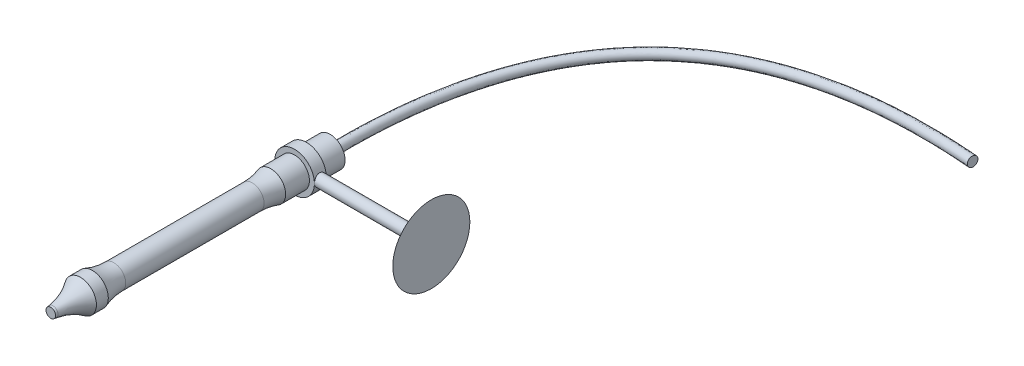
ISO-10303-21;
HEADER;
FILE_DESCRIPTION(('STEP AP214'),'2;1');
FILE_NAME('part.step','',(''),(''),'','','');
FILE_SCHEMA(('AUTOMOTIVE_DESIGN { 1 0 10303 214 1 1 1 1 }'));
ENDSEC;
DATA;
#1=APPLICATION_CONTEXT('core data for automotive mechanical design processes');
#2=APPLICATION_PROTOCOL_DEFINITION('international standard','automotive_design',2000,#1);
#3=PRODUCT_CONTEXT('',#1,'mechanical');
#4=PRODUCT('Part','Part','',(#3));
#5=PRODUCT_RELATED_PRODUCT_CATEGORY('part','',(#4));
#6=PRODUCT_DEFINITION_FORMATION('','',#4);
#7=PRODUCT_DEFINITION_CONTEXT('part definition',#1,'design');
#8=PRODUCT_DEFINITION('design','',#6,#7);
#9=PRODUCT_DEFINITION_SHAPE('','',#8);
#10=(LENGTH_UNIT() NAMED_UNIT(*) SI_UNIT(.MILLI.,.METRE.));
#11=(NAMED_UNIT(*) PLANE_ANGLE_UNIT() SI_UNIT($,.RADIAN.));
#12=(NAMED_UNIT(*) SI_UNIT($,.STERADIAN.) SOLID_ANGLE_UNIT());
#13=UNCERTAINTY_MEASURE_WITH_UNIT(LENGTH_MEASURE(1.E-05),#10,'distance_accuracy_value','');
#14=(GEOMETRIC_REPRESENTATION_CONTEXT(3) GLOBAL_UNCERTAINTY_ASSIGNED_CONTEXT((#13)) GLOBAL_UNIT_ASSIGNED_CONTEXT((#10,
#11,#12)) REPRESENTATION_CONTEXT('',''));
#15=CARTESIAN_POINT('',(0.,0.,0.));
#16=DIRECTION('',(0.,0.,1.));
#17=DIRECTION('',(1.,0.,0.));
#18=AXIS2_PLACEMENT_3D('',#15,#16,#17);
#19=CARTESIAN_POINT('',(0.,0.,4.));
#20=DIRECTION('',(0.,0.,1.));
#21=DIRECTION('',(1.,0.,0.));
#22=AXIS2_PLACEMENT_3D('',#19,#20,#21);
#23=CYLINDRICAL_SURFACE('',#22,3.33545911406675);
#24=CARTESIAN_POINT('',(0.,0.,4.));
#25=DIRECTION('',(0.,0.,-1.));
#26=DIRECTION('',(-1.,0.,0.));
#27=AXIS2_PLACEMENT_3D('',#24,#25,#26);
#28=CIRCLE('',#27,3.33545911406675);
#29=CARTESIAN_POINT('',(-3.33545911406675,0.,4.));
#30=VERTEX_POINT('',#29);
#31=EDGE_CURVE('E63',#30,#30,#28,.T.);
#32=ORIENTED_EDGE('',*,*,#31,.F.);
#33=EDGE_LOOP('',(#32));
#34=FACE_BOUND('',#33,.T.);
#35=CARTESIAN_POINT('',(0.,0.,6.));
#36=DIRECTION('',(0.,0.,-1.));
#37=DIRECTION('',(-1.,0.,0.));
#38=AXIS2_PLACEMENT_3D('',#35,#36,#37);
#39=CIRCLE('',#38,3.33545911406675);
#40=CARTESIAN_POINT('',(-3.33545911406675,0.,6.));
#41=VERTEX_POINT('',#40);
#42=EDGE_CURVE('E62',#41,#41,#39,.T.);
#43=ORIENTED_EDGE('',*,*,#42,.T.);
#44=EDGE_LOOP('',(#43));
#45=FACE_BOUND('',#44,.T.);
#46=CARTESIAN_POINT('',(3.33545911406675,0.,4.0123615803254));
#47=CARTESIAN_POINT('',(3.33545859474532,0.0542133240496529,4.01236232387684));
#48=CARTESIAN_POINT('',(3.33412468721525,0.108434184529217,4.01684020928572));
#49=CARTESIAN_POINT('',(3.32893368200549,0.215299004095399,4.03459226151468));
#50=CARTESIAN_POINT('',(3.32507577599388,0.267942452351953,4.04786924633869));
#51=CARTESIAN_POINT('',(3.31525987532415,0.370095511714682,4.08273883298903));
#52=CARTESIAN_POINT('',(3.30930493320031,0.419609555205668,4.10431935204747));
#53=CARTESIAN_POINT('',(3.295915162992,0.514316292113763,4.15513443939346));
#54=CARTESIAN_POINT('',(3.28848014949565,0.559508443066529,4.18436996678603));
#55=CARTESIAN_POINT('',(3.2726913390432,0.645555869772041,4.25052926292948));
#56=CARTESIAN_POINT('',(3.26431908206602,0.686272814123452,4.28762853201235));
#57=CARTESIAN_POINT('',(3.24771050900459,0.761007605381701,4.36808802331961));
#58=CARTESIAN_POINT('',(3.23947421528625,0.795024359974312,4.41144926442295));
#59=CARTESIAN_POINT('',(3.22387562790301,0.856114461558237,4.50436413942261));
#60=CARTESIAN_POINT('',(3.21653631853401,0.883020160804385,4.55403221935504));
#61=CARTESIAN_POINT('',(3.20383804372948,0.928041146304969,4.65744033353634));
#62=CARTESIAN_POINT('',(3.19847861665757,0.946158481994202,4.71117941505015));
#63=CARTESIAN_POINT('',(3.19053907662252,0.972591882833786,4.81965319708747));
#64=CARTESIAN_POINT('',(3.187886954268,0.981162475167788,4.87432046286353));
#65=CARTESIAN_POINT('',(3.1854479682639,0.989053755209431,4.98437632294314));
#66=CARTESIAN_POINT('',(3.18566043049727,0.988376619166253,5.03976474447351));
#67=CARTESIAN_POINT('',(3.18886271192411,0.977991844593223,5.14763132795278));
#68=CARTESIAN_POINT('',(3.19175487801695,0.968601705709039,5.20014343374472));
#69=CARTESIAN_POINT('',(3.19983290829458,0.941569905030586,5.30281084822294));
#70=CARTESIAN_POINT('',(3.20501899356802,0.923927447865862,5.35296592922286));
#71=CARTESIAN_POINT('',(3.21717940817788,0.880654971952299,5.45027836957983));
#72=CARTESIAN_POINT('',(3.22417679383611,0.854920973550015,5.49738648761944));
#73=CARTESIAN_POINT('',(3.23916013869764,0.796268204725903,5.58672277360935));
#74=CARTESIAN_POINT('',(3.24714633194111,0.763347731930148,5.62894978166258));
#75=CARTESIAN_POINT('',(3.26360477993206,0.689673939290382,5.70912766637599));
#76=CARTESIAN_POINT('',(3.27208360044128,0.648656736973535,5.74683512711562));
#77=CARTESIAN_POINT('',(3.28828403325024,0.560775574965283,5.81489214578275));
#78=CARTESIAN_POINT('',(3.29600560029437,0.51391126621399,5.84524126411412));
#79=CARTESIAN_POINT('',(3.30988897215643,0.415231866699017,5.89786278978185));
#80=CARTESIAN_POINT('',(3.3160405095211,0.363387092625176,5.92008242282251));
#81=CARTESIAN_POINT('',(3.3260167285635,0.256472291165546,5.95541562769836));
#82=CARTESIAN_POINT('',(3.32984204182267,0.201403143668695,5.96853167134033));
#83=CARTESIAN_POINT('',(3.33463543982902,0.0916731109890746,5.98488297386323));
#84=CARTESIAN_POINT('',(3.33569891673489,0.0370654964326703,5.98844825323522));
#85=CARTESIAN_POINT('',(3.33512799089891,-0.0719707270611069,5.98652015591804));
#86=CARTESIAN_POINT('',(3.33349393812181,-0.126399358301029,5.98102795430376));
#87=CARTESIAN_POINT('',(3.32777391494358,-0.232295271324664,5.96140817595549));
#88=CARTESIAN_POINT('',(3.32374243036412,-0.283801303316338,5.94747236605191));
#89=CARTESIAN_POINT('',(3.31369283249739,-0.383733818374663,5.91159069194744));
#90=CARTESIAN_POINT('',(3.3076744827287,-0.432159934043683,5.88964387422449));
#91=CARTESIAN_POINT('',(3.2941056600938,-0.525780656750882,5.83780218218657));
#92=CARTESIAN_POINT('',(3.28652346492846,-0.570876763874594,5.80773795131983));
#93=CARTESIAN_POINT('',(3.27069835550213,-0.655496754229677,5.74072147237581));
#94=CARTESIAN_POINT('',(3.26245528011169,-0.695019272042243,5.70376754158952));
#95=CARTESIAN_POINT('',(3.24587310157176,-0.768815953128473,5.62247097332805));
#96=CARTESIAN_POINT('',(3.23754088661774,-0.802855495652099,5.5779134998768));
#97=CARTESIAN_POINT('',(3.22203424603739,-0.86298936885423,5.48353809087203));
#98=CARTESIAN_POINT('',(3.2148597869735,-0.889083929013784,5.43372030731209));
#99=CARTESIAN_POINT('',(3.20256406341342,-0.932404778278876,5.33041159750006));
#100=CARTESIAN_POINT('',(3.19743285057474,-0.949674155766802,5.27693999164027));
#101=CARTESIAN_POINT('',(3.18982852883468,-0.974914655736116,5.16766826317063));
#102=CARTESIAN_POINT('',(3.18735453878674,-0.982888860611743,5.11186891882907));
#103=CARTESIAN_POINT('',(3.18543002280948,-0.989106837079643,5.00195847641877));
#104=CARTESIAN_POINT('',(3.18586086910518,-0.98773236916733,4.94787076579933));
#105=CARTESIAN_POINT('',(3.18941317481038,-0.976200136369812,4.8407345658914));
#106=CARTESIAN_POINT('',(3.19253453161151,-0.966042706441556,4.78768603705039));
#107=CARTESIAN_POINT('',(3.20103762949315,-0.937476437029475,4.68474042985967));
#108=CARTESIAN_POINT('',(3.20639231111525,-0.919166204991245,4.63481358970892));
#109=CARTESIAN_POINT('',(3.21875437264944,-0.874890678120699,4.53870078264029));
#110=CARTESIAN_POINT('',(3.22576206244756,-0.848923947711911,4.49251551933179));
#111=CARTESIAN_POINT('',(3.24095189232623,-0.788989851005709,4.40341903874876));
#112=CARTESIAN_POINT('',(3.24916695650304,-0.754770617418629,4.36068286163931));
#113=CARTESIAN_POINT('',(3.26568329629989,-0.679759336524921,4.28143555156332));
#114=CARTESIAN_POINT('',(3.27398459357433,-0.638965599013623,4.24492602435463));
#115=CARTESIAN_POINT('',(3.29001889545424,-0.550576160592224,4.17814299120523));
#116=CARTESIAN_POINT('',(3.29772924754409,-0.502820976000291,4.14807457607197));
#117=CARTESIAN_POINT('',(3.31144416480173,-0.402704738783865,4.09643638239578));
#118=CARTESIAN_POINT('',(3.31744956515563,-0.350345957793296,4.074862440747));
#119=CARTESIAN_POINT('',(3.32652213987926,-0.248676099276189,4.04286969867746));
#120=CARTESIAN_POINT('',(3.32984622601543,-0.199698039333411,4.03145958635817));
#121=CARTESIAN_POINT('',(3.33431478226766,-0.100482011016156,4.0162057779511));
#122=CARTESIAN_POINT('',(3.33545959536747,-0.050244242161485,4.01236089121107));
#123=CARTESIAN_POINT('',(3.33545911406675,0.,4.0123615803254));
#124=B_SPLINE_CURVE_WITH_KNOTS('',3,(#46,#47,#48,#49,#50,#51,#52,#53,#54,#55,#56,#57,#58,#59,
#60,#61,#62,#63,#64,#65,#66,#67,#68,#69,#70,#71,#72,#73,#74,#75,#76,#77,#78,#79,#80,#81,#82,#83,
#84,#85,#86,#87,#88,#89,#90,#91,#92,#93,#94,#95,#96,#97,#98,#99,#100,#101,#102,#103,#104,#105,
#106,#107,#108,#109,#110,#111,#112,#113,#114,#115,#116,#117,#118,#119,#120,#121,#122,#123),
.UNSPECIFIED.,.T.,.F.,(4,2,2,2,2,2,2,2,2,2,2,2,2,2,2,2,2,2,2,2,2,2,2,2,2,2,2,2,2,2,2,2,2,2,2,2,
2,2,4),(0.,0.162455450943634,0.324962955108748,0.487234877697006,0.64952714126232,
0.815917590518073,0.982335143557728,1.15238287694366,1.32239093633573,1.48774899339534,
1.65306813774909,1.81259013865982,1.97212751770235,2.13380512233315,2.2955210677378,
2.46380687081703,2.63210272501402,2.80147249638967,2.97079626247248,3.13418878121919,
3.29756010385816,3.45735326321316,3.61716544839054,3.78061099489834,3.9440965130223,
4.11335520971679,4.28260901711801,4.45102836331313,4.61939184366652,4.7809225607495,
4.94244711778646,5.10206898572496,5.26172080146197,5.42705502412562,5.59243181969801,
5.76247625113761,5.93243724047086,6.08302265673771,6.23358437123781),.UNSPECIFIED.);
#125=CARTESIAN_POINT('',(3.33545911406675,0.,4.0123615803254));
#126=VERTEX_POINT('',#125);
#127=EDGE_CURVE('E39',#126,#126,#124,.T.);
#128=ORIENTED_EDGE('',*,*,#127,.F.);
#129=EDGE_LOOP('',(#128));
#130=FACE_BOUND('',#129,.T.);
#131=ADVANCED_FACE('F35',(#34,#45,#130),#23,.T.);
#132=CARTESIAN_POINT('',(0.,0.,10.));
#133=DIRECTION('',(0.,0.,-1.));
#134=DIRECTION('',(-1.,0.,0.));
#135=AXIS2_PLACEMENT_3D('',#132,#133,#134);
#136=CYLINDRICAL_SURFACE('',#135,2.5);
#137=CARTESIAN_POINT('',(0.,0.,10.));
#138=DIRECTION('',(0.,0.,1.));
#139=DIRECTION('',(1.,0.,0.));
#140=AXIS2_PLACEMENT_3D('',#137,#138,#139);
#141=CIRCLE('',#140,2.5);
#142=CARTESIAN_POINT('',(2.5,0.,10.));
#143=VERTEX_POINT('',#142);
#144=EDGE_CURVE('E79',#143,#143,#141,.T.);
#145=ORIENTED_EDGE('',*,*,#144,.F.);
#146=EDGE_LOOP('',(#145));
#147=FACE_BOUND('',#146,.T.);
#148=CARTESIAN_POINT('',(0.,0.,6.));
#149=DIRECTION('',(0.,0.,-1.));
#150=DIRECTION('',(-1.,0.,0.));
#151=AXIS2_PLACEMENT_3D('',#148,#149,#150);
#152=CIRCLE('',#151,2.5);
#153=CARTESIAN_POINT('',(-2.5,0.,6.));
#154=VERTEX_POINT('',#153);
#155=EDGE_CURVE('E93',#154,#154,#152,.T.);
#156=ORIENTED_EDGE('',*,*,#155,.F.);
#157=EDGE_LOOP('',(#156));
#158=FACE_BOUND('',#157,.T.);
#159=ADVANCED_FACE('F110',(#147,#158),#136,.T.);
#160=CARTESIAN_POINT('',(0.,0.,40.));
#161=DIRECTION('',(0.,0.,-1.));
#162=DIRECTION('',(-1.,0.,0.));
#163=AXIS2_PLACEMENT_3D('',#160,#161,#162);
#164=CYLINDRICAL_SURFACE('',#163,2.);
#165=CARTESIAN_POINT('',(0.,0.,36.394285056652));
#166=DIRECTION('',(0.,0.,1.));
#167=DIRECTION('',(1.,0.,0.));
#168=AXIS2_PLACEMENT_3D('',#165,#166,#167);
#169=CIRCLE('',#168,2.);
#170=CARTESIAN_POINT('',(2.,0.,36.394285056652));
#171=VERTEX_POINT('',#170);
#172=EDGE_CURVE('E90',#171,#171,#169,.F.);
#173=ORIENTED_EDGE('',*,*,#172,.T.);
#174=EDGE_LOOP('',(#173));
#175=FACE_BOUND('',#174,.T.);
#176=CARTESIAN_POINT('',(0.,0.,13.1224989991992));
#177=DIRECTION('',(0.,0.,-1.));
#178=DIRECTION('',(-1.,0.,0.));
#179=AXIS2_PLACEMENT_3D('',#176,#177,#178);
#180=CIRCLE('',#179,2.);
#181=CARTESIAN_POINT('',(-2.,0.,13.1224989991992));
#182=VERTEX_POINT('',#181);
#183=EDGE_CURVE('E82',#182,#182,#180,.F.);
#184=ORIENTED_EDGE('',*,*,#183,.T.);
#185=EDGE_LOOP('',(#184));
#186=FACE_BOUND('',#185,.T.);
#187=ADVANCED_FACE('F149',(#175,#186),#164,.T.);
#188=CARTESIAN_POINT('',(0.,0.,42.));
#189=DIRECTION('',(0.,0.,-1.));
#190=DIRECTION('',(-1.,0.,0.));
#191=AXIS2_PLACEMENT_3D('',#188,#189,#190);
#192=CYLINDRICAL_SURFACE('',#191,2.67268421531054);
#193=CARTESIAN_POINT('',(0.,0.,42.));
#194=DIRECTION('',(0.,0.,1.));
#195=DIRECTION('',(1.,0.,0.));
#196=AXIS2_PLACEMENT_3D('',#193,#194,#195);
#197=CIRCLE('',#196,2.67268421531054);
#198=CARTESIAN_POINT('',(2.67268421531054,0.,42.));
#199=VERTEX_POINT('',#198);
#200=EDGE_CURVE('E73',#199,#199,#197,.T.);
#201=ORIENTED_EDGE('',*,*,#200,.F.);
#202=EDGE_LOOP('',(#201));
#203=FACE_BOUND('',#202,.T.);
#204=CARTESIAN_POINT('',(0.,0.,40.));
#205=DIRECTION('',(0.,0.,1.));
#206=DIRECTION('',(1.,0.,0.));
#207=AXIS2_PLACEMENT_3D('',#204,#205,#206);
#208=CIRCLE('',#207,2.67268421531054);
#209=CARTESIAN_POINT('',(2.67268421531054,0.,40.));
#210=VERTEX_POINT('',#209);
#211=EDGE_CURVE('E72',#210,#210,#208,.T.);
#212=ORIENTED_EDGE('',*,*,#211,.T.);
#213=EDGE_LOOP('',(#212));
#214=FACE_BOUND('',#213,.T.);
#215=ADVANCED_FACE('F145',(#203,#214),#192,.T.);
#216=CARTESIAN_POINT('',(0.,0.,42.));
#217=DIRECTION('',(0.,0.,-1.));
#218=DIRECTION('',(1.,0.,0.));
#219=AXIS2_PLACEMENT_3D('',#216,#217,#218);
#220=CONICAL_SURFACE('',#219,1.4240416063004,0.122173047639603);
#221=CARTESIAN_POINT('',(0.,0.,46.6349250458601));
#222=DIRECTION('',(0.,0.,1.));
#223=DIRECTION('',(1.,0.,0.));
#224=AXIS2_PLACEMENT_3D('',#221,#222,#223);
#225=CIRCLE('',#224,0.854944369726588);
#226=CARTESIAN_POINT('',(0.854944369726588,0.,46.6349250458601));
#227=VERTEX_POINT('',#226);
#228=EDGE_CURVE('E87',#227,#227,#225,.T.);
#229=ORIENTED_EDGE('',*,*,#228,.T.);
#230=EDGE_LOOP('',(#229));
#231=FACE_BOUND('',#230,.T.);
#232=CARTESIAN_POINT('',(0.,0.,47.));
#233=DIRECTION('',(0.,0.,1.));
#234=DIRECTION('',(1.,0.,0.));
#235=AXIS2_PLACEMENT_3D('',#232,#233,#234);
#236=CIRCLE('',#235,0.810118801785874);
#237=CARTESIAN_POINT('',(0.810118801785874,0.,47.));
#238=VERTEX_POINT('',#237);
#239=EDGE_CURVE('E69',#238,#238,#236,.T.);
#240=ORIENTED_EDGE('',*,*,#239,.F.);
#241=EDGE_LOOP('',(#240));
#242=FACE_BOUND('',#241,.T.);
#243=ADVANCED_FACE('F141',(#231,#242),#220,.T.);
#244=CARTESIAN_POINT('',(0.,0.,47.));
#245=DIRECTION('',(0.,0.,1.));
#246=DIRECTION('',(1.,0.,0.));
#247=AXIS2_PLACEMENT_3D('',#244,#245,#246);
#248=PLANE('',#247);
#249=ORIENTED_EDGE('',*,*,#239,.T.);
#250=EDGE_LOOP('',(#249));
#251=FACE_BOUND('',#250,.T.);
#252=ADVANCED_FACE('F137',(#251),#248,.T.);
#253=CARTESIAN_POINT('',(0.,0.,13.1224989991992));
#254=DIRECTION('',(0.,0.,-1.));
#255=DIRECTION('',(-1.,0.,0.));
#256=AXIS2_PLACEMENT_3D('',#253,#254,#255);
#257=TOROIDAL_SURFACE('',#256,12.,10.);
#258=ORIENTED_EDGE('',*,*,#144,.T.);
#259=EDGE_LOOP('',(#258));
#260=FACE_BOUND('',#259,.T.);
#261=ORIENTED_EDGE('',*,*,#183,.F.);
#262=EDGE_LOOP('',(#261));
#263=FACE_BOUND('',#262,.T.);
#264=ADVANCED_FACE('F140',(#260,#263),#257,.F.);
#265=CARTESIAN_POINT('',(0.,0.,47.8536184799116));
#266=DIRECTION('',(0.,0.,-1.));
#267=DIRECTION('',(-1.,0.,0.));
#268=AXIS2_PLACEMENT_3D('',#265,#266,#267);
#269=TOROIDAL_SURFACE('',#268,10.7804058861398,10.);
#270=ORIENTED_EDGE('',*,*,#200,.T.);
#271=EDGE_LOOP('',(#270));
#272=FACE_BOUND('',#271,.T.);
#273=ORIENTED_EDGE('',*,*,#228,.F.);
#274=EDGE_LOOP('',(#273));
#275=FACE_BOUND('',#274,.T.);
#276=ADVANCED_FACE('F158',(#272,#275),#269,.F.);
#277=CARTESIAN_POINT('',(0.,0.,36.394285056652));
#278=DIRECTION('',(0.,0.,1.));
#279=DIRECTION('',(1.,0.,0.));
#280=AXIS2_PLACEMENT_3D('',#277,#278,#279);
#281=TOROIDAL_SURFACE('',#280,12.,10.);
#282=ORIENTED_EDGE('',*,*,#172,.F.);
#283=EDGE_LOOP('',(#282));
#284=FACE_BOUND('',#283,.T.);
#285=ORIENTED_EDGE('',*,*,#211,.F.);
#286=EDGE_LOOP('',(#285));
#287=FACE_BOUND('',#286,.T.);
#288=ADVANCED_FACE('F37',(#284,#287),#281,.F.);
#289=CARTESIAN_POINT('',(0.,0.,4.));
#290=DIRECTION('',(0.,0.,-1.));
#291=DIRECTION('',(-1.,0.,0.));
#292=AXIS2_PLACEMENT_3D('',#289,#290,#291);
#293=PLANE('',#292);
#294=CARTESIAN_POINT('',(0.,0.,4.));
#295=DIRECTION('',(0.,0.,-1.));
#296=DIRECTION('',(-1.,0.,0.));
#297=AXIS2_PLACEMENT_3D('',#294,#295,#296);
#298=CIRCLE('',#297,2.5);
#299=CARTESIAN_POINT('',(-2.5,0.,4.));
#300=VERTEX_POINT('',#299);
#301=EDGE_CURVE('E66',#300,#300,#298,.T.);
#302=ORIENTED_EDGE('',*,*,#301,.F.);
#303=EDGE_LOOP('',(#302));
#304=FACE_BOUND('',#303,.T.);
#305=ORIENTED_EDGE('',*,*,#31,.T.);
#306=EDGE_LOOP('',(#305));
#307=FACE_BOUND('',#306,.T.);
#308=ADVANCED_FACE('F101',(#304,#307),#293,.T.);
#309=CARTESIAN_POINT('',(0.,0.,6.));
#310=DIRECTION('',(0.,0.,-1.));
#311=DIRECTION('',(-1.,0.,0.));
#312=AXIS2_PLACEMENT_3D('',#309,#310,#311);
#313=PLANE('',#312);
#314=ORIENTED_EDGE('',*,*,#155,.T.);
#315=EDGE_LOOP('',(#314));
#316=FACE_BOUND('',#315,.T.);
#317=ORIENTED_EDGE('',*,*,#42,.F.);
#318=EDGE_LOOP('',(#317));
#319=FACE_BOUND('',#318,.T.);
#320=ADVANCED_FACE('F104',(#316,#319),#313,.F.);
#321=CARTESIAN_POINT('',(0.,0.,0.));
#322=DIRECTION('',(0.,0.,1.));
#323=DIRECTION('',(1.,0.,0.));
#324=AXIS2_PLACEMENT_3D('',#321,#322,#323);
#325=PLANE('',#324);
#326=CARTESIAN_POINT('',(0.,0.,0.));
#327=DIRECTION('',(0.,0.,-1.));
#328=DIRECTION('',(-1.,0.,0.));
#329=AXIS2_PLACEMENT_3D('',#326,#327,#328);
#330=CIRCLE('',#329,0.823056941418801);
#331=CARTESIAN_POINT('',(-0.823056941418801,0.,0.));
#332=VERTEX_POINT('',#331);
#333=EDGE_CURVE('E11',#332,#332,#330,.T.);
#334=ORIENTED_EDGE('',*,*,#333,.F.);
#335=EDGE_LOOP('',(#334));
#336=FACE_BOUND('',#335,.T.);
#337=CARTESIAN_POINT('',(0.,0.,0.));
#338=DIRECTION('',(0.,0.,1.));
#339=DIRECTION('',(1.,0.,0.));
#340=AXIS2_PLACEMENT_3D('',#337,#338,#339);
#341=CIRCLE('',#340,2.5);
#342=CARTESIAN_POINT('',(2.5,0.,0.));
#343=VERTEX_POINT('',#342);
#344=EDGE_CURVE('E76',#343,#343,#341,.T.);
#345=ORIENTED_EDGE('',*,*,#344,.F.);
#346=EDGE_LOOP('',(#345));
#347=FACE_BOUND('',#346,.T.);
#348=ADVANCED_FACE('F127',(#336,#347),#325,.F.);
#349=ORIENTED_EDGE('',*,*,#301,.T.);
#350=EDGE_LOOP('',(#349));
#351=FACE_BOUND('',#350,.T.);
#352=ORIENTED_EDGE('',*,*,#344,.T.);
#353=EDGE_LOOP('',(#352));
#354=FACE_BOUND('',#353,.T.);
#355=ADVANCED_FACE('F98',(#351,#354),#136,.T.);
#356=CARTESIAN_POINT('',(20.,0.,5.));
#357=DIRECTION('',(-1.,0.,0.));
#358=DIRECTION('',(0.,0.,1.));
#359=AXIS2_PLACEMENT_3D('',#356,#357,#358);
#360=CYLINDRICAL_SURFACE('',#359,0.987638419674596);
#361=CARTESIAN_POINT('',(20.,0.,5.));
#362=DIRECTION('',(1.,0.,0.));
#363=DIRECTION('',(0.,0.,-1.));
#364=AXIS2_PLACEMENT_3D('',#361,#362,#363);
#365=CIRCLE('',#364,0.987638419674596);
#366=CARTESIAN_POINT('',(20.,0.,4.01236158032541));
#367=VERTEX_POINT('',#366);
#368=EDGE_CURVE('E57',#367,#367,#365,.T.);
#369=ORIENTED_EDGE('',*,*,#368,.F.);
#370=EDGE_LOOP('',(#369));
#371=FACE_BOUND('',#370,.T.);
#372=ORIENTED_EDGE('',*,*,#127,.T.);
#373=EDGE_LOOP('',(#372));
#374=FACE_BOUND('',#373,.T.);
#375=ADVANCED_FACE('F116',(#371,#374),#360,.T.);
#376=CARTESIAN_POINT('',(20.,0.,5.));
#377=DIRECTION('',(1.,0.,0.));
#378=DIRECTION('',(0.,0.,-1.));
#379=AXIS2_PLACEMENT_3D('',#376,#377,#378);
#380=CONICAL_SURFACE('',#379,0.987638419674596,1.22173047639603);
#381=CARTESIAN_POINT('',(22.,0.,5.));
#382=DIRECTION('',(1.,0.,0.));
#383=DIRECTION('',(0.,0.,-1.));
#384=AXIS2_PLACEMENT_3D('',#381,#382,#383);
#385=CIRCLE('',#384,6.48259325858386);
#386=CARTESIAN_POINT('',(22.,0.,-1.48259325858385));
#387=VERTEX_POINT('',#386);
#388=EDGE_CURVE('E54',#387,#387,#385,.T.);
#389=CARTESIAN_POINT('',(22.,0.,-1.48259325858385));
#390=CARTESIAN_POINT('',(21.9791666666667,0.,-1.42535414567855));
#391=CARTESIAN_POINT('',(21.9583333333333,0.,-1.36811503277324));
#392=CARTESIAN_POINT('',(21.9166666666667,0.,-1.25363680696263));
#393=CARTESIAN_POINT('',(21.8958333333333,0.,-1.19639769405733));
#394=CARTESIAN_POINT('',(21.8541666666667,0.,-1.08191946824672));
#395=CARTESIAN_POINT('',(21.8333333333333,0.,-1.02468035534141));
#396=CARTESIAN_POINT('',(21.7916666666667,0.,-0.910202129530804));
#397=CARTESIAN_POINT('',(21.7708333333333,0.,-0.8529630166255));
#398=CARTESIAN_POINT('',(21.7291666666667,0.,-0.73848479081489));
#399=CARTESIAN_POINT('',(21.7083333333333,0.,-0.681245677909585));
#400=CARTESIAN_POINT('',(21.6666666666667,0.,-0.566767452098975));
#401=CARTESIAN_POINT('',(21.6458333333333,0.,-0.50952833919367));
#402=CARTESIAN_POINT('',(21.6041666666667,0.,-0.395050113383061));
#403=CARTESIAN_POINT('',(21.5833333333333,0.,-0.337811000477756));
#404=CARTESIAN_POINT('',(21.5416666666667,0.,-0.223332774667147));
#405=CARTESIAN_POINT('',(21.5208333333333,0.,-0.166093661761842));
#406=CARTESIAN_POINT('',(21.4791666666667,0.,-0.0516154359512319));
#407=CARTESIAN_POINT('',(21.4583333333333,0.,0.00562367695407298));
#408=CARTESIAN_POINT('',(21.4166666666667,0.,0.120101902764683));
#409=CARTESIAN_POINT('',(21.3958333333333,0.,0.177341015669987));
#410=CARTESIAN_POINT('',(21.3541666666667,0.,0.291819241480596));
#411=CARTESIAN_POINT('',(21.3333333333333,0.,0.349058354385901));
#412=CARTESIAN_POINT('',(21.2916666666667,0.,0.463536580196511));
#413=CARTESIAN_POINT('',(21.2708333333333,0.,0.520775693101815));
#414=CARTESIAN_POINT('',(21.2291666666667,0.,0.635253918912425));
#415=CARTESIAN_POINT('',(21.2083333333333,0.,0.69249303181773));
#416=CARTESIAN_POINT('',(21.1666666666667,0.,0.80697125762834));
#417=CARTESIAN_POINT('',(21.1458333333333,0.,0.864210370533644));
#418=CARTESIAN_POINT('',(21.1041666666667,0.,0.978688596344254));
#419=CARTESIAN_POINT('',(21.0833333333333,0.,1.03592770924956));
#420=CARTESIAN_POINT('',(21.0416666666667,0.,1.15040593506017));
#421=CARTESIAN_POINT('',(21.0208333333333,0.,1.20764504796547));
#422=CARTESIAN_POINT('',(20.9791666666667,0.,1.32212327377608));
#423=CARTESIAN_POINT('',(20.9583333333333,0.,1.37936238668139));
#424=CARTESIAN_POINT('',(20.9166666666667,0.,1.493840612492));
#425=CARTESIAN_POINT('',(20.8958333333333,0.,1.5510797253973));
#426=CARTESIAN_POINT('',(20.8541666666667,0.,1.66555795120791));
#427=CARTESIAN_POINT('',(20.8333333333333,0.,1.72279706411322));
#428=CARTESIAN_POINT('',(20.7916666666667,0.,1.83727528992383));
#429=CARTESIAN_POINT('',(20.7708333333333,0.,1.89451440282913));
#430=CARTESIAN_POINT('',(20.7291666666667,0.,2.00899262863974));
#431=CARTESIAN_POINT('',(20.7083333333333,0.,2.06623174154505));
#432=CARTESIAN_POINT('',(20.6666666666667,0.,2.18070996735565));
#433=CARTESIAN_POINT('',(20.6458333333333,0.,2.23794908026096));
#434=CARTESIAN_POINT('',(20.6041666666667,0.,2.35242730607157));
#435=CARTESIAN_POINT('',(20.5833333333333,0.,2.40966641897687));
#436=CARTESIAN_POINT('',(20.5416666666667,0.,2.52414464478748));
#437=CARTESIAN_POINT('',(20.5208333333333,0.,2.58138375769279));
#438=CARTESIAN_POINT('',(20.4791666666667,0.,2.6958619835034));
#439=CARTESIAN_POINT('',(20.4583333333333,0.,2.7531010964087));
#440=CARTESIAN_POINT('',(20.4166666666667,0.,2.86757932221931));
#441=CARTESIAN_POINT('',(20.3958333333333,0.,2.92481843512462));
#442=CARTESIAN_POINT('',(20.3541666666667,0.,3.03929666093523));
#443=CARTESIAN_POINT('',(20.3333333333333,0.,3.09653577384053));
#444=CARTESIAN_POINT('',(20.2916666666667,0.,3.21101399965114));
#445=CARTESIAN_POINT('',(20.2708333333333,0.,3.26825311255645));
#446=CARTESIAN_POINT('',(20.2291666666667,0.,3.38273133836706));
#447=CARTESIAN_POINT('',(20.2083333333333,0.,3.43997045127236));
#448=CARTESIAN_POINT('',(20.1666666666667,0.,3.55444867708297));
#449=CARTESIAN_POINT('',(20.1458333333333,0.,3.61168778998828));
#450=CARTESIAN_POINT('',(20.1041666666667,0.,3.72616601579888));
#451=CARTESIAN_POINT('',(20.0833333333333,0.,3.78340512870419));
#452=CARTESIAN_POINT('',(20.0416666666667,0.,3.8978833545148));
#453=CARTESIAN_POINT('',(20.0208333333333,0.,3.9551224674201));
#454=CARTESIAN_POINT('',(20.,0.,4.01236158032541));
#455=B_SPLINE_CURVE_WITH_KNOTS('',3,(#389,#390,#391,#392,#393,#394,#395,#396,#397,#398,#399,
#400,#401,#402,#403,#404,#405,#406,#407,#408,#409,#410,#411,#412,#413,#414,#415,#416,#417,#418,
#419,#420,#421,#422,#423,#424,#425,#426,#427,#428,#429,#430,#431,#432,#433,#434,#435,#436,#437,
#438,#439,#440,#441,#442,#443,#444,#445,#446,#447,#448,#449,#450,#451,#452,#453,#454),
.UNSPECIFIED.,.F.,.F.,(4,2,2,2,2,2,2,2,2,2,2,2,2,2,2,2,2,2,2,2,2,2,2,2,2,2,2,2,2,2,2,2,4),(0.,
0.182737775010194,0.365475550020387,0.548213325030581,0.730951100040773,0.913688875050967,
1.09642665006116,1.27916442507135,1.46190220008155,1.64463997509174,1.82737775010193,
2.01011552511213,2.19285330012232,2.37559107513251,2.55832885014271,2.7410666251529,
2.9238044001631,3.10654217517329,3.28927995018348,3.47201772519367,3.65475550020387,
3.83749327521406,4.02023105022425,4.20296882523445,4.38570660024464,4.56844437525484,
4.75118215026503,4.93391992527522,5.11665770028542,5.29939547529561,5.4821332503058,
5.664871025316,5.84760880032619),.UNSPECIFIED.);
#456=EDGE_CURVE('BSEAM118',#387,#367,#455,.T.);
#457=ORIENTED_EDGE('',*,*,#388,.F.);
#458=ORIENTED_EDGE('',*,*,#368,.T.);
#459=ORIENTED_EDGE('',*,*,#456,.T.);
#460=ORIENTED_EDGE('',*,*,#456,.F.);
#461=EDGE_LOOP('',(#457,#459,#458,#460));
#462=FACE_BOUND('',#461,.T.);
#463=ADVANCED_FACE('F118',(#462),#380,.T.);
#464=CARTESIAN_POINT('',(22.,0.,5.));
#465=DIRECTION('',(1.,0.,0.));
#466=DIRECTION('',(0.,0.,-1.));
#467=AXIS2_PLACEMENT_3D('',#464,#465,#466);
#468=PLANE('',#467);
#469=ORIENTED_EDGE('',*,*,#388,.T.);
#470=EDGE_LOOP('',(#469));
#471=FACE_BOUND('',#470,.T.);
#472=ADVANCED_FACE('F124',(#471),#468,.T.);
#473=CARTESIAN_POINT('',(55.4731266351647,0.,-52.5785864035224));
#474=DIRECTION('',(0.994894215806792,0.,0.10092323495701));
#475=DIRECTION('',(0.10092323495701,0.,-0.994894215806792));
#476=AXIS2_PLACEMENT_3D('',#473,#474,#475);
#477=PLANE('',#476);
#478=CARTESIAN_POINT('',(55.4731266351647,0.,-52.5785864035224));
#479=DIRECTION('',(0.994894215806792,0.,0.10092323495701));
#480=DIRECTION('',(0.10092323495701,0.,-0.994894215806792));
#481=AXIS2_PLACEMENT_3D('',#478,#479,#480);
#482=CIRCLE('',#481,0.823056941418801);
#483=CARTESIAN_POINT('',(55.5561922042465,0.,-53.3974409938196));
#484=VERTEX_POINT('',#483);
#485=EDGE_CURVE('E51',#484,#484,#482,.T.);
#486=ORIENTED_EDGE('',*,*,#485,.T.);
#487=EDGE_LOOP('',(#486));
#488=FACE_BOUND('',#487,.T.);
#489=ADVANCED_FACE('F52',(#488),#477,.T.);
#490=CARTESIAN_POINT('',(-0.823056941418801,0.,0.));
#491=CARTESIAN_POINT('',(-1.00528514868458,0.,-9.60549848291007));
#492=CARTESIAN_POINT('',(0.0204274545560473,0.,-17.9424398413057));
#493=CARTESIAN_POINT('',(4.53528441007579,0.,-32.0802969077914));
#494=CARTESIAN_POINT('',(8.03201383470082,0.,-37.882374219091));
#495=CARTESIAN_POINT('',(17.5018181728053,0.,-46.8500622553068));
#496=CARTESIAN_POINT('',(23.4650720689064,0.,-50.006212498284));
#497=CARTESIAN_POINT('',(37.7434076421809,0.,-53.6668925612425));
#498=CARTESIAN_POINT('',(46.0599789416722,0.,-54.1791215015874));
#499=CARTESIAN_POINT('',(55.5561922042465,0.,-53.3974409938196));
#500=CARTESIAN_POINT('',(-0.823056941418801,1.6461138828376,0.));
#501=CARTESIAN_POINT('',(-1.00528514868458,1.6461138828376,-9.60549848291007));
#502=CARTESIAN_POINT('',(0.0204274545560473,1.6461138828376,-17.9424398413057));
#503=CARTESIAN_POINT('',(4.53528441007579,1.6461138828376,-32.0802969077914));
#504=CARTESIAN_POINT('',(8.03201383470082,1.6461138828376,-37.882374219091));
#505=CARTESIAN_POINT('',(17.5018181728053,1.6461138828376,-46.8500622553068));
#506=CARTESIAN_POINT('',(23.4650720689064,1.6461138828376,-50.006212498284));
#507=CARTESIAN_POINT('',(37.7434076421809,1.6461138828376,-53.6668925612425));
#508=CARTESIAN_POINT('',(46.0599789416722,1.6461138828376,-54.1791215015874));
#509=CARTESIAN_POINT('',(55.5561922042465,1.6461138828376,-53.3974409938196));
#510=CARTESIAN_POINT('',(0.823056941418801,1.6461138828376,0.));
#511=CARTESIAN_POINT('',(0.640828734178876,1.6461138828376,-9.47016787390358));
#512=CARTESIAN_POINT('',(1.65315409652762,1.6461138828376,-17.6307507165661));
#513=CARTESIAN_POINT('',(6.01936183236701,1.6461138828376,-31.3316577408789));
#514=CARTESIAN_POINT('',(9.36565913351412,1.6461138828376,-36.8708203192069));
#515=CARTESIAN_POINT('',(18.3868970071248,1.6461138828376,-45.4293277507996));
#516=CARTESIAN_POINT('',(24.0716585969764,1.6461138828376,-48.4581330859659));
#517=CARTESIAN_POINT('',(37.8943427557921,1.6461138828376,-52.0110798680946));
#518=CARTESIAN_POINT('',(46.030775702527,1.6461138828376,-52.5275221943615));
#519=CARTESIAN_POINT('',(55.3900610660828,1.6461138828376,-51.7597318132252));
#520=CARTESIAN_POINT('',(0.823056941418801,0.,0.));
#521=CARTESIAN_POINT('',(0.640828734178876,0.,-9.47016787390358));
#522=CARTESIAN_POINT('',(1.65315409652762,0.,-17.6307507165661));
#523=CARTESIAN_POINT('',(6.01936183236701,0.,-31.3316577408789));
#524=CARTESIAN_POINT('',(9.36565913351412,0.,-36.8708203192069));
#525=CARTESIAN_POINT('',(18.3868970071248,0.,-45.4293277507996));
#526=CARTESIAN_POINT('',(24.0716585969764,0.,-48.4581330859659));
#527=CARTESIAN_POINT('',(37.8943427557921,0.,-52.0110798680946));
#528=CARTESIAN_POINT('',(46.030775702527,0.,-52.5275221943615));
#529=CARTESIAN_POINT('',(55.3900610660828,0.,-51.7597318132252));
#530=CARTESIAN_POINT('',(0.823056941418802,-1.6461138828376,0.));
#531=CARTESIAN_POINT('',(0.640828734178876,-1.6461138828376,-9.47016787390358));
#532=CARTESIAN_POINT('',(1.65315409652762,-1.6461138828376,-17.6307507165661));
#533=CARTESIAN_POINT('',(6.01936183236701,-1.6461138828376,-31.3316577408789));
#534=CARTESIAN_POINT('',(9.36565913351412,-1.6461138828376,-36.8708203192069));
#535=CARTESIAN_POINT('',(18.3868970071248,-1.6461138828376,-45.4293277507996));
#536=CARTESIAN_POINT('',(24.0716585969764,-1.6461138828376,-48.4581330859659));
#537=CARTESIAN_POINT('',(37.8943427557921,-1.6461138828376,-52.0110798680946));
#538=CARTESIAN_POINT('',(46.030775702527,-1.6461138828376,-52.5275221943615));
#539=CARTESIAN_POINT('',(55.3900610660828,-1.6461138828376,-51.7597318132252));
#540=CARTESIAN_POINT('',(-0.823056941418801,-1.6461138828376,0.));
#541=CARTESIAN_POINT('',(-1.00528514868458,-1.6461138828376,-9.60549848291007));
#542=CARTESIAN_POINT('',(0.0204274545560473,-1.6461138828376,-17.9424398413057));
#543=CARTESIAN_POINT('',(4.53528441007579,-1.6461138828376,-32.0802969077914));
#544=CARTESIAN_POINT('',(8.03201383470082,-1.6461138828376,-37.882374219091));
#545=CARTESIAN_POINT('',(17.5018181728053,-1.6461138828376,-46.8500622553068));
#546=CARTESIAN_POINT('',(23.4650720689064,-1.6461138828376,-50.006212498284));
#547=CARTESIAN_POINT('',(37.7434076421809,-1.6461138828376,-53.6668925612425));
#548=CARTESIAN_POINT('',(46.0599789416722,-1.6461138828376,-54.1791215015874));
#549=CARTESIAN_POINT('',(55.5561922042465,-1.6461138828376,-53.3974409938196));
#550=CARTESIAN_POINT('',(-0.823056941418801,0.,0.));
#551=CARTESIAN_POINT('',(-1.00528514868458,0.,-9.60549848291007));
#552=CARTESIAN_POINT('',(0.0204274545560473,0.,-17.9424398413057));
#553=CARTESIAN_POINT('',(4.53528441007579,0.,-32.0802969077914));
#554=CARTESIAN_POINT('',(8.03201383470082,0.,-37.882374219091));
#555=CARTESIAN_POINT('',(17.5018181728053,0.,-46.8500622553068));
#556=CARTESIAN_POINT('',(23.4650720689064,0.,-50.006212498284));
#557=CARTESIAN_POINT('',(37.7434076421809,0.,-53.6668925612425));
#558=CARTESIAN_POINT('',(46.0599789416722,0.,-54.1791215015874));
#559=CARTESIAN_POINT('',(55.5561922042465,0.,-53.3974409938196));
#560=(BOUNDED_SURFACE() B_SPLINE_SURFACE(3,3,((#490,#491,#492,#493,#494,#495,#496,#497,#498,
#499),(#500,#501,#502,#503,#504,#505,#506,#507,#508,#509),(#510,#511,#512,#513,#514,#515,#516,
#517,#518,#519),(#520,#521,#522,#523,#524,#525,#526,#527,#528,#529),(#530,#531,#532,#533,#534,
#535,#536,#537,#538,#539),(#540,#541,#542,#543,#544,#545,#546,#547,#548,#549),(#550,#551,#552,
#553,#554,#555,#556,#557,#558,#559)),.UNSPECIFIED.,.T.,.F.,.F.) B_SPLINE_SURFACE_WITH_KNOTS((4,
3,4),(4,2,2,2,4),(0.,0.5,1.),(0.,0.25,0.5,0.75,1.),
.UNSPECIFIED.) GEOMETRIC_REPRESENTATION_ITEM() RATIONAL_B_SPLINE_SURFACE(((1.,1.,1.,1.,1.,1.,1.,
1.,1.,1.),(0.333333333333333,0.333333333333333,0.333333333333333,0.333333333333333,
0.333333333333333,0.333333333333333,0.333333333333333,0.333333333333333,0.333333333333333,
0.333333333333333),(0.333333333333333,0.333333333333333,0.333333333333333,0.333333333333333,
0.333333333333333,0.333333333333333,0.333333333333333,0.333333333333333,0.333333333333333,
0.333333333333333),(1.,1.,1.,1.,1.,1.,1.,1.,1.,1.),(0.333333333333333,0.333333333333333,
0.333333333333333,0.333333333333333,0.333333333333333,0.333333333333333,0.333333333333333,
0.333333333333333,0.333333333333333,0.333333333333333),(0.333333333333333,0.333333333333333,
0.333333333333333,0.333333333333333,0.333333333333333,0.333333333333333,0.333333333333333,
0.333333333333333,0.333333333333333,0.333333333333333),(1.,1.,1.,1.,1.,1.,1.,1.,1.,1.))) REPRESENTATION_ITEM('') SURFACE());
#561=ORIENTED_EDGE('',*,*,#485,.F.);
#562=EDGE_LOOP('',(#561));
#563=FACE_BOUND('',#562,.T.);
#564=ORIENTED_EDGE('',*,*,#333,.T.);
#565=EDGE_LOOP('',(#564));
#566=FACE_BOUND('',#565,.T.);
#567=ADVANCED_FACE('F231',(#563,#566),#560,.T.);
#568=CLOSED_SHELL('',(#131,#159,#187,#215,#243,#252,#264,#276,#288,#308,#320,#348,#355,#375,
#463,#472,#489,#567));
#569=MANIFOLD_SOLID_BREP('B2',#568);
#570=ADVANCED_BREP_SHAPE_REPRESENTATION('',(#18,#569),#14);
#571=SHAPE_DEFINITION_REPRESENTATION(#9,#570);
ENDSEC;
END-ISO-10303-21;
